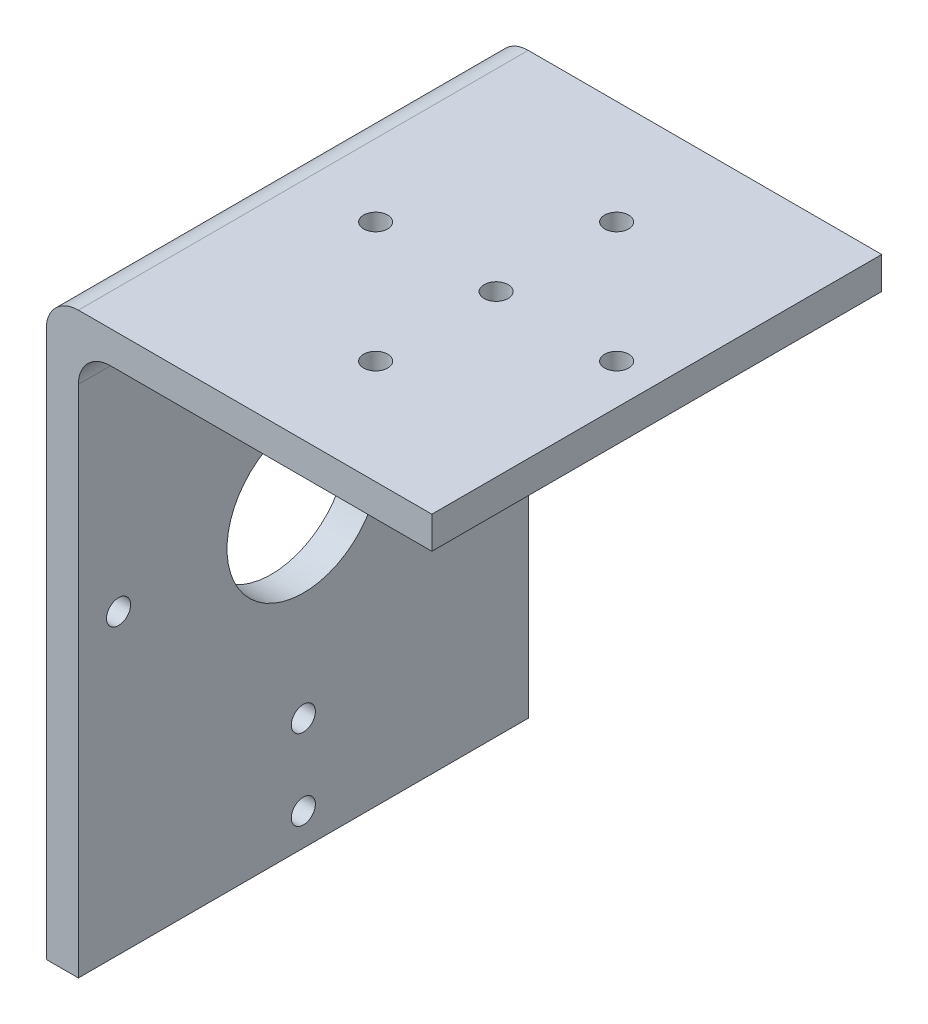
ISO-10303-21;
HEADER;
FILE_DESCRIPTION(('STEP AP214'),'2;1');
FILE_NAME('part.step','',(''),(''),'','','');
FILE_SCHEMA(('AUTOMOTIVE_DESIGN { 1 0 10303 214 1 1 1 1 }'));
ENDSEC;
DATA;
#1=APPLICATION_CONTEXT('core data for automotive mechanical design processes');
#2=APPLICATION_PROTOCOL_DEFINITION('international standard','automotive_design',2000,#1);
#3=PRODUCT_CONTEXT('',#1,'mechanical');
#4=PRODUCT('Part','Part','',(#3));
#5=PRODUCT_RELATED_PRODUCT_CATEGORY('part','',(#4));
#6=PRODUCT_DEFINITION_FORMATION('','',#4);
#7=PRODUCT_DEFINITION_CONTEXT('part definition',#1,'design');
#8=PRODUCT_DEFINITION('design','',#6,#7);
#9=PRODUCT_DEFINITION_SHAPE('','',#8);
#10=(LENGTH_UNIT() NAMED_UNIT(*) SI_UNIT(.MILLI.,.METRE.));
#11=(NAMED_UNIT(*) PLANE_ANGLE_UNIT() SI_UNIT($,.RADIAN.));
#12=(NAMED_UNIT(*) SI_UNIT($,.STERADIAN.) SOLID_ANGLE_UNIT());
#13=UNCERTAINTY_MEASURE_WITH_UNIT(LENGTH_MEASURE(1.E-05),#10,'distance_accuracy_value','');
#14=(GEOMETRIC_REPRESENTATION_CONTEXT(3) GLOBAL_UNCERTAINTY_ASSIGNED_CONTEXT((#13)) GLOBAL_UNIT_ASSIGNED_CONTEXT((#10,
#11,#12)) REPRESENTATION_CONTEXT('',''));
#15=CARTESIAN_POINT('',(0.,0.,0.));
#16=DIRECTION('',(0.,0.,1.));
#17=DIRECTION('',(1.,0.,0.));
#18=AXIS2_PLACEMENT_3D('',#15,#16,#17);
#19=CARTESIAN_POINT('',(-30.3062448440852,12.6016746411483,-28.));
#20=DIRECTION('',(-1.,0.,0.));
#21=DIRECTION('',(0.,-1.,0.));
#22=AXIS2_PLACEMENT_3D('',#19,#20,#21);
#23=PLANE('',#22);
#24=CARTESIAN_POINT('',(-30.3062448440851,-55.3983253588517,0.));
#25=DIRECTION('',(1.,0.,0.));
#26=DIRECTION('',(0.,0.,-1.));
#27=AXIS2_PLACEMENT_3D('',#24,#25,#26);
#28=CIRCLE('',#27,1.5);
#29=CARTESIAN_POINT('',(-30.3062448440851,-55.3983253588517,-1.5));
#30=VERTEX_POINT('',#29);
#31=EDGE_CURVE('E342',#30,#30,#28,.T.);
#32=ORIENTED_EDGE('',*,*,#31,.T.);
#33=EDGE_LOOP('',(#32));
#34=FACE_BOUND('',#33,.T.);
#35=CARTESIAN_POINT('',(-30.3062448440851,-45.3983253588517,0.));
#36=DIRECTION('',(1.,0.,0.));
#37=DIRECTION('',(0.,0.,-1.));
#38=AXIS2_PLACEMENT_3D('',#35,#36,#37);
#39=CIRCLE('',#38,1.5);
#40=CARTESIAN_POINT('',(-30.3062448440851,-45.3983253588517,-1.5));
#41=VERTEX_POINT('',#40);
#42=EDGE_CURVE('E348',#41,#41,#39,.T.);
#43=ORIENTED_EDGE('',*,*,#42,.T.);
#44=EDGE_LOOP('',(#43));
#45=FACE_BOUND('',#44,.T.);
#46=CARTESIAN_POINT('',(-30.3062448440851,-22.3983253588517,-23.));
#47=DIRECTION('',(1.,0.,0.));
#48=DIRECTION('',(0.,0.,-1.));
#49=AXIS2_PLACEMENT_3D('',#46,#47,#48);
#50=CIRCLE('',#49,1.5);
#51=CARTESIAN_POINT('',(-30.3062448440851,-22.3983253588517,-24.5));
#52=VERTEX_POINT('',#51);
#53=EDGE_CURVE('E353',#52,#52,#50,.T.);
#54=ORIENTED_EDGE('',*,*,#53,.T.);
#55=EDGE_LOOP('',(#54));
#56=FACE_BOUND('',#55,.T.);
#57=CARTESIAN_POINT('',(-30.3062448440851,0.601674641148332,0.));
#58=DIRECTION('',(1.,0.,0.));
#59=DIRECTION('',(0.,0.,-1.));
#60=AXIS2_PLACEMENT_3D('',#57,#58,#59);
#61=CIRCLE('',#60,1.5);
#62=CARTESIAN_POINT('',(-30.3062448440851,0.601674641148332,-1.5));
#63=VERTEX_POINT('',#62);
#64=EDGE_CURVE('E359',#63,#63,#61,.T.);
#65=ORIENTED_EDGE('',*,*,#64,.T.);
#66=EDGE_LOOP('',(#65));
#67=FACE_BOUND('',#66,.T.);
#68=CARTESIAN_POINT('',(-30.3062448440851,-22.3983253588517,23.));
#69=DIRECTION('',(1.,0.,0.));
#70=DIRECTION('',(0.,0.,-1.));
#71=AXIS2_PLACEMENT_3D('',#68,#69,#70);
#72=CIRCLE('',#71,1.5);
#73=CARTESIAN_POINT('',(-30.3062448440851,-22.3983253588517,21.5));
#74=VERTEX_POINT('',#73);
#75=EDGE_CURVE('E365',#74,#74,#72,.T.);
#76=ORIENTED_EDGE('',*,*,#75,.T.);
#77=EDGE_LOOP('',(#76));
#78=FACE_BOUND('',#77,.T.);
#79=CARTESIAN_POINT('',(-30.3062448440851,-22.3983253588517,0.));
#80=DIRECTION('',(1.,0.,0.));
#81=DIRECTION('',(0.,0.,-1.));
#82=AXIS2_PLACEMENT_3D('',#79,#80,#81);
#83=CIRCLE('',#82,9.5);
#84=CARTESIAN_POINT('',(-30.3062448440851,-22.3983253588517,-9.5));
#85=VERTEX_POINT('',#84);
#86=EDGE_CURVE('E102',#85,#85,#83,.T.);
#87=ORIENTED_EDGE('',*,*,#86,.T.);
#88=EDGE_LOOP('',(#87));
#89=FACE_BOUND('',#88,.T.);
#90=DIRECTION('',(0.,-1.,0.));
#91=VECTOR('',#90,1.);
#92=CARTESIAN_POINT('',(-30.3062448440852,12.6016746411483,28.));
#93=LINE('',#92,#91);
#94=CARTESIAN_POINT('',(-30.3062448440852,8.60167464114834,28.));
#95=VERTEX_POINT('',#94);
#96=CARTESIAN_POINT('',(-30.3062448440851,-59.3983253588517,28.));
#97=VERTEX_POINT('',#96);
#98=EDGE_CURVE('E95',#95,#97,#93,.T.);
#99=ORIENTED_EDGE('',*,*,#98,.F.);
#100=DIRECTION('',(0.,0.,1.));
#101=VECTOR('',#100,1.);
#102=CARTESIAN_POINT('',(-30.3062448440852,8.60167464114834,-28.));
#103=LINE('',#102,#101);
#104=CARTESIAN_POINT('',(-30.3062448440852,8.60167464114834,-28.));
#105=VERTEX_POINT('',#104);
#106=EDGE_CURVE('E48',#95,#105,#103,.F.);
#107=ORIENTED_EDGE('',*,*,#106,.T.);
#108=DIRECTION('',(0.,-1.,0.));
#109=VECTOR('',#108,1.);
#110=CARTESIAN_POINT('',(-30.3062448440852,12.6016746411483,-28.));
#111=LINE('',#110,#109);
#112=CARTESIAN_POINT('',(-30.3062448440851,-59.3983253588517,-28.));
#113=VERTEX_POINT('',#112);
#114=EDGE_CURVE('E106',#105,#113,#111,.T.);
#115=ORIENTED_EDGE('',*,*,#114,.T.);
#116=DIRECTION('',(0.,0.,1.));
#117=VECTOR('',#116,1.);
#118=CARTESIAN_POINT('',(-30.3062448440851,-59.3983253588517,-28.));
#119=LINE('',#118,#117);
#120=EDGE_CURVE('E105',#113,#97,#119,.T.);
#121=ORIENTED_EDGE('',*,*,#120,.T.);
#122=EDGE_LOOP('',(#99,#107,#115,#121));
#123=FACE_BOUND('',#122,.T.);
#124=ADVANCED_FACE('F33',(#34,#45,#56,#67,#78,#89,#123),#23,.T.);
#125=CARTESIAN_POINT('',(17.6937551559149,12.6016746411483,-28.));
#126=DIRECTION('',(0.,1.,0.));
#127=DIRECTION('',(-1.,0.,0.));
#128=AXIS2_PLACEMENT_3D('',#125,#126,#127);
#129=PLANE('',#128);
#130=CARTESIAN_POINT('',(-2.3062448440853,12.6016746411483,-15.));
#131=DIRECTION('',(0.,-1.,0.));
#132=DIRECTION('',(0.,0.,-1.));
#133=AXIS2_PLACEMENT_3D('',#130,#131,#132);
#134=CIRCLE('',#133,1.5);
#135=CARTESIAN_POINT('',(-2.3062448440853,12.6016746411483,-16.5));
#136=VERTEX_POINT('',#135);
#137=EDGE_CURVE('E313',#136,#136,#134,.T.);
#138=ORIENTED_EDGE('',*,*,#137,.T.);
#139=EDGE_LOOP('',(#138));
#140=FACE_BOUND('',#139,.T.);
#141=CARTESIAN_POINT('',(12.6937551559149,12.6016746411483,-1.04744440165294E-13));
#142=DIRECTION('',(0.,-1.,0.));
#143=DIRECTION('',(0.,0.,-1.));
#144=AXIS2_PLACEMENT_3D('',#141,#142,#143);
#145=CIRCLE('',#144,1.5);
#146=CARTESIAN_POINT('',(12.6937551559149,12.6016746411483,-1.50000000000011));
#147=VERTEX_POINT('',#146);
#148=EDGE_CURVE('E321',#147,#147,#145,.T.);
#149=ORIENTED_EDGE('',*,*,#148,.T.);
#150=EDGE_LOOP('',(#149));
#151=FACE_BOUND('',#150,.T.);
#152=CARTESIAN_POINT('',(-2.30624484408509,12.6016746411483,15.));
#153=DIRECTION('',(0.,-1.,0.));
#154=DIRECTION('',(0.,0.,-1.));
#155=AXIS2_PLACEMENT_3D('',#152,#153,#154);
#156=CIRCLE('',#155,1.5);
#157=CARTESIAN_POINT('',(-2.30624484408509,12.6016746411483,13.5));
#158=VERTEX_POINT('',#157);
#159=EDGE_CURVE('E327',#158,#158,#156,.T.);
#160=ORIENTED_EDGE('',*,*,#159,.T.);
#161=EDGE_LOOP('',(#160));
#162=FACE_BOUND('',#161,.T.);
#163=CARTESIAN_POINT('',(-17.3062448440851,12.6016746411483,0.));
#164=DIRECTION('',(0.,-1.,0.));
#165=DIRECTION('',(0.,0.,-1.));
#166=AXIS2_PLACEMENT_3D('',#163,#164,#165);
#167=CIRCLE('',#166,1.5);
#168=CARTESIAN_POINT('',(-17.3062448440851,12.6016746411483,-1.5));
#169=VERTEX_POINT('',#168);
#170=EDGE_CURVE('E333',#169,#169,#167,.T.);
#171=ORIENTED_EDGE('',*,*,#170,.T.);
#172=EDGE_LOOP('',(#171));
#173=FACE_BOUND('',#172,.T.);
#174=CARTESIAN_POINT('',(-2.30624484408514,12.6016746411483,0.));
#175=DIRECTION('',(0.,-1.,0.));
#176=DIRECTION('',(0.,0.,-1.));
#177=AXIS2_PLACEMENT_3D('',#174,#175,#176);
#178=CIRCLE('',#177,1.5);
#179=CARTESIAN_POINT('',(-2.30624484408514,12.6016746411483,-1.5));
#180=VERTEX_POINT('',#179);
#181=EDGE_CURVE('E339',#180,#180,#178,.T.);
#182=ORIENTED_EDGE('',*,*,#181,.T.);
#183=EDGE_LOOP('',(#182));
#184=FACE_BOUND('',#183,.T.);
#185=DIRECTION('',(-1.,0.,0.));
#186=VECTOR('',#185,1.);
#187=CARTESIAN_POINT('',(17.6937551559149,12.6016746411483,-28.));
#188=LINE('',#187,#186);
#189=CARTESIAN_POINT('',(17.6937551559149,12.6016746411483,-28.));
#190=VERTEX_POINT('',#189);
#191=CARTESIAN_POINT('',(-26.3062448440851,12.6016746411483,-28.));
#192=VERTEX_POINT('',#191);
#193=EDGE_CURVE('E111',#190,#192,#188,.T.);
#194=ORIENTED_EDGE('',*,*,#193,.T.);
#195=DIRECTION('',(0.,0.,1.));
#196=VECTOR('',#195,1.);
#197=CARTESIAN_POINT('',(-26.3062448440851,12.6016746411483,-28.));
#198=LINE('',#197,#196);
#199=CARTESIAN_POINT('',(-26.3062448440851,12.6016746411483,28.));
#200=VERTEX_POINT('',#199);
#201=EDGE_CURVE('E150',#192,#200,#198,.T.);
#202=ORIENTED_EDGE('',*,*,#201,.T.);
#203=DIRECTION('',(-1.,0.,0.));
#204=VECTOR('',#203,1.);
#205=CARTESIAN_POINT('',(17.6937551559149,12.6016746411483,28.));
#206=LINE('',#205,#204);
#207=CARTESIAN_POINT('',(17.6937551559149,12.6016746411483,28.));
#208=VERTEX_POINT('',#207);
#209=EDGE_CURVE('E124',#208,#200,#206,.T.);
#210=ORIENTED_EDGE('',*,*,#209,.F.);
#211=DIRECTION('',(0.,0.,1.));
#212=VECTOR('',#211,1.);
#213=CARTESIAN_POINT('',(17.6937551559149,12.6016746411483,-28.));
#214=LINE('',#213,#212);
#215=EDGE_CURVE('E139',#190,#208,#214,.T.);
#216=ORIENTED_EDGE('',*,*,#215,.F.);
#217=EDGE_LOOP('',(#194,#202,#210,#216));
#218=FACE_BOUND('',#217,.T.);
#219=ADVANCED_FACE('F187',(#140,#151,#162,#173,#184,#218),#129,.T.);
#220=CARTESIAN_POINT('',(17.6937551559149,8.60167464114833,-28.));
#221=DIRECTION('',(1.,0.,0.));
#222=DIRECTION('',(0.,0.,-1.));
#223=AXIS2_PLACEMENT_3D('',#220,#221,#222);
#224=PLANE('',#223);
#225=ORIENTED_EDGE('',*,*,#215,.T.);
#226=DIRECTION('',(0.,1.,0.));
#227=VECTOR('',#226,1.);
#228=CARTESIAN_POINT('',(17.6937551559149,8.60167464114833,28.));
#229=LINE('',#228,#227);
#230=CARTESIAN_POINT('',(17.6937551559149,8.60167464114833,28.));
#231=VERTEX_POINT('',#230);
#232=EDGE_CURVE('E121',#231,#208,#229,.T.);
#233=ORIENTED_EDGE('',*,*,#232,.F.);
#234=DIRECTION('',(0.,0.,1.));
#235=VECTOR('',#234,1.);
#236=CARTESIAN_POINT('',(17.6937551559149,8.60167464114833,-28.));
#237=LINE('',#236,#235);
#238=CARTESIAN_POINT('',(17.6937551559149,8.60167464114833,-28.));
#239=VERTEX_POINT('',#238);
#240=EDGE_CURVE('E142',#239,#231,#237,.T.);
#241=ORIENTED_EDGE('',*,*,#240,.F.);
#242=DIRECTION('',(0.,1.,0.));
#243=VECTOR('',#242,1.);
#244=CARTESIAN_POINT('',(17.6937551559149,8.60167464114833,-28.));
#245=LINE('',#244,#243);
#246=EDGE_CURVE('E134',#239,#190,#245,.T.);
#247=ORIENTED_EDGE('',*,*,#246,.T.);
#248=EDGE_LOOP('',(#225,#233,#241,#247));
#249=FACE_BOUND('',#248,.T.);
#250=ADVANCED_FACE('F181',(#249),#224,.T.);
#251=CARTESIAN_POINT('',(-26.3062448440851,8.60167464114833,-28.));
#252=DIRECTION('',(0.,-1.,0.));
#253=DIRECTION('',(0.,0.,-1.));
#254=AXIS2_PLACEMENT_3D('',#251,#252,#253);
#255=PLANE('',#254);
#256=CARTESIAN_POINT('',(-2.3062448440853,8.60167464114833,-15.));
#257=DIRECTION('',(0.,-1.,0.));
#258=DIRECTION('',(0.,0.,-1.));
#259=AXIS2_PLACEMENT_3D('',#256,#257,#258);
#260=CIRCLE('',#259,1.5);
#261=CARTESIAN_POINT('',(-2.3062448440853,8.60167464114833,-16.5));
#262=VERTEX_POINT('',#261);
#263=EDGE_CURVE('E316',#262,#262,#260,.T.);
#264=ORIENTED_EDGE('',*,*,#263,.F.);
#265=EDGE_LOOP('',(#264));
#266=FACE_BOUND('',#265,.T.);
#267=CARTESIAN_POINT('',(12.6937551559149,8.60167464114833,-1.04744440165294E-13));
#268=DIRECTION('',(0.,-1.,0.));
#269=DIRECTION('',(0.,0.,-1.));
#270=AXIS2_PLACEMENT_3D('',#267,#268,#269);
#271=CIRCLE('',#270,1.5);
#272=CARTESIAN_POINT('',(12.6937551559149,8.60167464114833,-1.50000000000011));
#273=VERTEX_POINT('',#272);
#274=EDGE_CURVE('E318',#273,#273,#271,.T.);
#275=ORIENTED_EDGE('',*,*,#274,.F.);
#276=EDGE_LOOP('',(#275));
#277=FACE_BOUND('',#276,.T.);
#278=CARTESIAN_POINT('',(-2.30624484408509,8.60167464114833,15.));
#279=DIRECTION('',(0.,-1.,0.));
#280=DIRECTION('',(0.,0.,-1.));
#281=AXIS2_PLACEMENT_3D('',#278,#279,#280);
#282=CIRCLE('',#281,1.5);
#283=CARTESIAN_POINT('',(-2.30624484408509,8.60167464114833,13.5));
#284=VERTEX_POINT('',#283);
#285=EDGE_CURVE('E324',#284,#284,#282,.T.);
#286=ORIENTED_EDGE('',*,*,#285,.F.);
#287=EDGE_LOOP('',(#286));
#288=FACE_BOUND('',#287,.T.);
#289=CARTESIAN_POINT('',(-17.3062448440851,8.60167464114833,0.));
#290=DIRECTION('',(0.,-1.,0.));
#291=DIRECTION('',(0.,0.,-1.));
#292=AXIS2_PLACEMENT_3D('',#289,#290,#291);
#293=CIRCLE('',#292,1.5);
#294=CARTESIAN_POINT('',(-17.3062448440851,8.60167464114833,-1.5));
#295=VERTEX_POINT('',#294);
#296=EDGE_CURVE('E330',#295,#295,#293,.T.);
#297=ORIENTED_EDGE('',*,*,#296,.F.);
#298=EDGE_LOOP('',(#297));
#299=FACE_BOUND('',#298,.T.);
#300=CARTESIAN_POINT('',(-2.30624484408514,8.60167464114833,0.));
#301=DIRECTION('',(0.,-1.,0.));
#302=DIRECTION('',(0.,0.,-1.));
#303=AXIS2_PLACEMENT_3D('',#300,#301,#302);
#304=CIRCLE('',#303,1.5);
#305=CARTESIAN_POINT('',(-2.30624484408514,8.60167464114833,-1.5));
#306=VERTEX_POINT('',#305);
#307=EDGE_CURVE('E336',#306,#306,#304,.T.);
#308=ORIENTED_EDGE('',*,*,#307,.F.);
#309=EDGE_LOOP('',(#308));
#310=FACE_BOUND('',#309,.T.);
#311=DIRECTION('',(1.,0.,0.));
#312=VECTOR('',#311,1.);
#313=CARTESIAN_POINT('',(-26.3062448440851,8.60167464114833,28.));
#314=LINE('',#313,#312);
#315=CARTESIAN_POINT('',(-22.3062448440851,8.60167464114833,28.));
#316=VERTEX_POINT('',#315);
#317=EDGE_CURVE('E116',#316,#231,#314,.T.);
#318=ORIENTED_EDGE('',*,*,#317,.F.);
#319=DIRECTION('',(0.,0.,1.));
#320=VECTOR('',#319,1.);
#321=CARTESIAN_POINT('',(-22.3062448440851,8.60167464114833,-28.));
#322=LINE('',#321,#320);
#323=CARTESIAN_POINT('',(-22.3062448440851,8.60167464114833,-28.));
#324=VERTEX_POINT('',#323);
#325=EDGE_CURVE('E148',#316,#324,#322,.F.);
#326=ORIENTED_EDGE('',*,*,#325,.T.);
#327=DIRECTION('',(1.,0.,0.));
#328=VECTOR('',#327,1.);
#329=CARTESIAN_POINT('',(-26.3062448440851,8.60167464114833,-28.));
#330=LINE('',#329,#328);
#331=EDGE_CURVE('E132',#324,#239,#330,.T.);
#332=ORIENTED_EDGE('',*,*,#331,.T.);
#333=ORIENTED_EDGE('',*,*,#240,.T.);
#334=EDGE_LOOP('',(#318,#326,#332,#333));
#335=FACE_BOUND('',#334,.T.);
#336=ADVANCED_FACE('F161',(#266,#277,#288,#299,#310,#335),#255,.T.);
#337=CARTESIAN_POINT('',(-26.3062448440851,-59.3983253588517,-28.));
#338=DIRECTION('',(1.,0.,0.));
#339=DIRECTION('',(0.,0.,-1.));
#340=AXIS2_PLACEMENT_3D('',#337,#338,#339);
#341=PLANE('',#340);
#342=CARTESIAN_POINT('',(-26.3062448440851,-55.3983253588517,0.));
#343=DIRECTION('',(1.,0.,0.));
#344=DIRECTION('',(0.,0.,-1.));
#345=AXIS2_PLACEMENT_3D('',#342,#343,#344);
#346=CIRCLE('',#345,1.5);
#347=CARTESIAN_POINT('',(-26.3062448440851,-55.3983253588517,-1.5));
#348=VERTEX_POINT('',#347);
#349=EDGE_CURVE('E345',#348,#348,#346,.T.);
#350=ORIENTED_EDGE('',*,*,#349,.F.);
#351=EDGE_LOOP('',(#350));
#352=FACE_BOUND('',#351,.T.);
#353=CARTESIAN_POINT('',(-26.3062448440851,-45.3983253588517,0.));
#354=DIRECTION('',(1.,0.,0.));
#355=DIRECTION('',(0.,0.,-1.));
#356=AXIS2_PLACEMENT_3D('',#353,#354,#355);
#357=CIRCLE('',#356,1.5);
#358=CARTESIAN_POINT('',(-26.3062448440851,-45.3983253588517,-1.5));
#359=VERTEX_POINT('',#358);
#360=EDGE_CURVE('E350',#359,#359,#357,.T.);
#361=ORIENTED_EDGE('',*,*,#360,.F.);
#362=EDGE_LOOP('',(#361));
#363=FACE_BOUND('',#362,.T.);
#364=CARTESIAN_POINT('',(-26.3062448440851,-22.3983253588517,-23.));
#365=DIRECTION('',(1.,0.,0.));
#366=DIRECTION('',(0.,0.,-1.));
#367=AXIS2_PLACEMENT_3D('',#364,#365,#366);
#368=CIRCLE('',#367,1.5);
#369=CARTESIAN_POINT('',(-26.3062448440851,-22.3983253588517,-24.5));
#370=VERTEX_POINT('',#369);
#371=EDGE_CURVE('E356',#370,#370,#368,.T.);
#372=ORIENTED_EDGE('',*,*,#371,.F.);
#373=EDGE_LOOP('',(#372));
#374=FACE_BOUND('',#373,.T.);
#375=CARTESIAN_POINT('',(-26.3062448440851,0.601674641148332,0.));
#376=DIRECTION('',(1.,0.,0.));
#377=DIRECTION('',(0.,0.,-1.));
#378=AXIS2_PLACEMENT_3D('',#375,#376,#377);
#379=CIRCLE('',#378,1.5);
#380=CARTESIAN_POINT('',(-26.3062448440851,0.601674641148332,-1.5));
#381=VERTEX_POINT('',#380);
#382=EDGE_CURVE('E362',#381,#381,#379,.T.);
#383=ORIENTED_EDGE('',*,*,#382,.F.);
#384=EDGE_LOOP('',(#383));
#385=FACE_BOUND('',#384,.T.);
#386=CARTESIAN_POINT('',(-26.3062448440851,-22.3983253588517,23.));
#387=DIRECTION('',(1.,0.,0.));
#388=DIRECTION('',(0.,0.,-1.));
#389=AXIS2_PLACEMENT_3D('',#386,#387,#388);
#390=CIRCLE('',#389,1.5);
#391=CARTESIAN_POINT('',(-26.3062448440851,-22.3983253588517,21.5));
#392=VERTEX_POINT('',#391);
#393=EDGE_CURVE('E368',#392,#392,#390,.T.);
#394=ORIENTED_EDGE('',*,*,#393,.F.);
#395=EDGE_LOOP('',(#394));
#396=FACE_BOUND('',#395,.T.);
#397=CARTESIAN_POINT('',(-26.3062448440851,-22.3983253588517,0.));
#398=DIRECTION('',(1.,0.,0.));
#399=DIRECTION('',(0.,0.,-1.));
#400=AXIS2_PLACEMENT_3D('',#397,#398,#399);
#401=CIRCLE('',#400,9.5);
#402=CARTESIAN_POINT('',(-26.3062448440851,-22.3983253588517,-9.5));
#403=VERTEX_POINT('',#402);
#404=EDGE_CURVE('E371',#403,#403,#401,.T.);
#405=ORIENTED_EDGE('',*,*,#404,.F.);
#406=EDGE_LOOP('',(#405));
#407=FACE_BOUND('',#406,.T.);
#408=DIRECTION('',(0.,1.,0.));
#409=VECTOR('',#408,1.);
#410=CARTESIAN_POINT('',(-26.3062448440851,-59.3983253588517,-28.));
#411=LINE('',#410,#409);
#412=CARTESIAN_POINT('',(-26.3062448440851,-59.3983253588517,-28.));
#413=VERTEX_POINT('',#412);
#414=CARTESIAN_POINT('',(-26.3062448440851,4.60167464114831,-28.));
#415=VERTEX_POINT('',#414);
#416=EDGE_CURVE('E129',#413,#415,#411,.T.);
#417=ORIENTED_EDGE('',*,*,#416,.T.);
#418=DIRECTION('',(0.,0.,1.));
#419=VECTOR('',#418,1.);
#420=CARTESIAN_POINT('',(-26.3062448440851,4.60167464114831,28.));
#421=LINE('',#420,#419);
#422=CARTESIAN_POINT('',(-26.3062448440851,4.60167464114831,28.));
#423=VERTEX_POINT('',#422);
#424=EDGE_CURVE('E141',#415,#423,#421,.T.);
#425=ORIENTED_EDGE('',*,*,#424,.T.);
#426=DIRECTION('',(0.,1.,0.));
#427=VECTOR('',#426,1.);
#428=CARTESIAN_POINT('',(-26.3062448440851,-59.3983253588517,28.));
#429=LINE('',#428,#427);
#430=CARTESIAN_POINT('',(-26.3062448440851,-59.3983253588517,28.));
#431=VERTEX_POINT('',#430);
#432=EDGE_CURVE('E114',#431,#423,#429,.T.);
#433=ORIENTED_EDGE('',*,*,#432,.F.);
#434=DIRECTION('',(0.,0.,1.));
#435=VECTOR('',#434,1.);
#436=CARTESIAN_POINT('',(-26.3062448440851,-59.3983253588517,-28.));
#437=LINE('',#436,#435);
#438=EDGE_CURVE('E110',#413,#431,#437,.T.);
#439=ORIENTED_EDGE('',*,*,#438,.F.);
#440=EDGE_LOOP('',(#417,#425,#433,#439));
#441=FACE_BOUND('',#440,.T.);
#442=ADVANCED_FACE('F172',(#352,#363,#374,#385,#396,#407,#441),#341,.T.);
#443=CARTESIAN_POINT('',(-30.3062448440851,-59.3983253588517,-28.));
#444=DIRECTION('',(0.,-1.,0.));
#445=DIRECTION('',(0.,0.,-1.));
#446=AXIS2_PLACEMENT_3D('',#443,#444,#445);
#447=PLANE('',#446);
#448=ORIENTED_EDGE('',*,*,#438,.T.);
#449=DIRECTION('',(1.,0.,0.));
#450=VECTOR('',#449,1.);
#451=CARTESIAN_POINT('',(-30.3062448440851,-59.3983253588517,28.));
#452=LINE('',#451,#450);
#453=EDGE_CURVE('E100',#97,#431,#452,.T.);
#454=ORIENTED_EDGE('',*,*,#453,.F.);
#455=ORIENTED_EDGE('',*,*,#120,.F.);
#456=DIRECTION('',(1.,0.,0.));
#457=VECTOR('',#456,1.);
#458=CARTESIAN_POINT('',(-30.3062448440851,-59.3983253588517,-28.));
#459=LINE('',#458,#457);
#460=EDGE_CURVE('E127',#113,#413,#459,.T.);
#461=ORIENTED_EDGE('',*,*,#460,.T.);
#462=EDGE_LOOP('',(#448,#454,#455,#461));
#463=FACE_BOUND('',#462,.T.);
#464=ADVANCED_FACE('F113',(#463),#447,.T.);
#465=CARTESIAN_POINT('',(0.,0.,-28.));
#466=DIRECTION('',(0.,0.,1.));
#467=DIRECTION('',(1.,0.,0.));
#468=AXIS2_PLACEMENT_3D('',#465,#466,#467);
#469=PLANE('',#468);
#470=ORIENTED_EDGE('',*,*,#114,.F.);
#471=CARTESIAN_POINT('',(-26.3062448440851,8.60167464114834,-28.));
#472=DIRECTION('',(0.,0.,1.));
#473=DIRECTION('',(1.,0.,0.));
#474=AXIS2_PLACEMENT_3D('',#471,#472,#473);
#475=CIRCLE('',#474,4.);
#476=EDGE_CURVE('E155',#105,#192,#475,.F.);
#477=ORIENTED_EDGE('',*,*,#476,.T.);
#478=ORIENTED_EDGE('',*,*,#193,.F.);
#479=ORIENTED_EDGE('',*,*,#246,.F.);
#480=ORIENTED_EDGE('',*,*,#331,.F.);
#481=CARTESIAN_POINT('',(-22.3062448440851,4.60167464114831,-28.));
#482=DIRECTION('',(0.,0.,1.));
#483=DIRECTION('',(1.,0.,0.));
#484=AXIS2_PLACEMENT_3D('',#481,#482,#483);
#485=CIRCLE('',#484,4.);
#486=EDGE_CURVE('E11',#324,#415,#485,.T.);
#487=ORIENTED_EDGE('',*,*,#486,.T.);
#488=ORIENTED_EDGE('',*,*,#416,.F.);
#489=ORIENTED_EDGE('',*,*,#460,.F.);
#490=EDGE_LOOP('',(#470,#477,#478,#479,#480,#487,#488,#489));
#491=FACE_BOUND('',#490,.T.);
#492=ADVANCED_FACE('F169',(#491),#469,.F.);
#493=CARTESIAN_POINT('',(0.,0.,28.));
#494=DIRECTION('',(0.,0.,1.));
#495=DIRECTION('',(1.,0.,0.));
#496=AXIS2_PLACEMENT_3D('',#493,#494,#495);
#497=PLANE('',#496);
#498=ORIENTED_EDGE('',*,*,#209,.T.);
#499=CARTESIAN_POINT('',(-26.3062448440851,8.60167464114834,28.));
#500=DIRECTION('',(0.,0.,1.));
#501=DIRECTION('',(1.,0.,0.));
#502=AXIS2_PLACEMENT_3D('',#499,#500,#501);
#503=CIRCLE('',#502,4.);
#504=EDGE_CURVE('E56',#200,#95,#503,.T.);
#505=ORIENTED_EDGE('',*,*,#504,.T.);
#506=ORIENTED_EDGE('',*,*,#98,.T.);
#507=ORIENTED_EDGE('',*,*,#453,.T.);
#508=ORIENTED_EDGE('',*,*,#432,.T.);
#509=CARTESIAN_POINT('',(-22.3062448440851,4.60167464114831,28.));
#510=DIRECTION('',(0.,0.,1.));
#511=DIRECTION('',(1.,0.,0.));
#512=AXIS2_PLACEMENT_3D('',#509,#510,#511);
#513=CIRCLE('',#512,4.);
#514=EDGE_CURVE('E41',#423,#316,#513,.F.);
#515=ORIENTED_EDGE('',*,*,#514,.T.);
#516=ORIENTED_EDGE('',*,*,#317,.T.);
#517=ORIENTED_EDGE('',*,*,#232,.T.);
#518=EDGE_LOOP('',(#498,#505,#506,#507,#508,#515,#516,#517));
#519=FACE_BOUND('',#518,.T.);
#520=ADVANCED_FACE('F97',(#519),#497,.T.);
#521=CARTESIAN_POINT('',(-30.3062448440851,-22.3983253588517,0.));
#522=DIRECTION('',(1.,0.,0.));
#523=DIRECTION('',(0.,0.,-1.));
#524=AXIS2_PLACEMENT_3D('',#521,#522,#523);
#525=CYLINDRICAL_SURFACE('',#524,9.5);
#526=ORIENTED_EDGE('',*,*,#86,.F.);
#527=EDGE_LOOP('',(#526));
#528=FACE_BOUND('',#527,.T.);
#529=ORIENTED_EDGE('',*,*,#404,.T.);
#530=EDGE_LOOP('',(#529));
#531=FACE_BOUND('',#530,.T.);
#532=ADVANCED_FACE('F229',(#528,#531),#525,.F.);
#533=CARTESIAN_POINT('',(-30.3062448440851,-22.3983253588517,23.));
#534=DIRECTION('',(1.,0.,0.));
#535=DIRECTION('',(0.,0.,-1.));
#536=AXIS2_PLACEMENT_3D('',#533,#534,#535);
#537=CYLINDRICAL_SURFACE('',#536,1.5);
#538=ORIENTED_EDGE('',*,*,#75,.F.);
#539=EDGE_LOOP('',(#538));
#540=FACE_BOUND('',#539,.T.);
#541=ORIENTED_EDGE('',*,*,#393,.T.);
#542=EDGE_LOOP('',(#541));
#543=FACE_BOUND('',#542,.T.);
#544=ADVANCED_FACE('F225',(#540,#543),#537,.F.);
#545=CARTESIAN_POINT('',(-30.3062448440851,0.601674641148332,0.));
#546=DIRECTION('',(1.,0.,0.));
#547=DIRECTION('',(0.,0.,-1.));
#548=AXIS2_PLACEMENT_3D('',#545,#546,#547);
#549=CYLINDRICAL_SURFACE('',#548,1.5);
#550=ORIENTED_EDGE('',*,*,#64,.F.);
#551=EDGE_LOOP('',(#550));
#552=FACE_BOUND('',#551,.T.);
#553=ORIENTED_EDGE('',*,*,#382,.T.);
#554=EDGE_LOOP('',(#553));
#555=FACE_BOUND('',#554,.T.);
#556=ADVANCED_FACE('F221',(#552,#555),#549,.F.);
#557=CARTESIAN_POINT('',(-30.3062448440851,-22.3983253588517,-23.));
#558=DIRECTION('',(1.,0.,0.));
#559=DIRECTION('',(0.,0.,-1.));
#560=AXIS2_PLACEMENT_3D('',#557,#558,#559);
#561=CYLINDRICAL_SURFACE('',#560,1.5);
#562=ORIENTED_EDGE('',*,*,#53,.F.);
#563=EDGE_LOOP('',(#562));
#564=FACE_BOUND('',#563,.T.);
#565=ORIENTED_EDGE('',*,*,#371,.T.);
#566=EDGE_LOOP('',(#565));
#567=FACE_BOUND('',#566,.T.);
#568=ADVANCED_FACE('F211',(#564,#567),#561,.F.);
#569=CARTESIAN_POINT('',(-30.3062448440851,-45.3983253588517,0.));
#570=DIRECTION('',(1.,0.,0.));
#571=DIRECTION('',(0.,0.,-1.));
#572=AXIS2_PLACEMENT_3D('',#569,#570,#571);
#573=CYLINDRICAL_SURFACE('',#572,1.5);
#574=ORIENTED_EDGE('',*,*,#42,.F.);
#575=EDGE_LOOP('',(#574));
#576=FACE_BOUND('',#575,.T.);
#577=ORIENTED_EDGE('',*,*,#360,.T.);
#578=EDGE_LOOP('',(#577));
#579=FACE_BOUND('',#578,.T.);
#580=ADVANCED_FACE('F205',(#576,#579),#573,.F.);
#581=CARTESIAN_POINT('',(-30.3062448440851,-55.3983253588517,0.));
#582=DIRECTION('',(1.,0.,0.));
#583=DIRECTION('',(0.,0.,-1.));
#584=AXIS2_PLACEMENT_3D('',#581,#582,#583);
#585=CYLINDRICAL_SURFACE('',#584,1.5);
#586=ORIENTED_EDGE('',*,*,#31,.F.);
#587=EDGE_LOOP('',(#586));
#588=FACE_BOUND('',#587,.T.);
#589=ORIENTED_EDGE('',*,*,#349,.T.);
#590=EDGE_LOOP('',(#589));
#591=FACE_BOUND('',#590,.T.);
#592=ADVANCED_FACE('F198',(#588,#591),#585,.F.);
#593=CARTESIAN_POINT('',(-22.3062448440851,4.60167464114831,-28.));
#594=DIRECTION('',(0.,0.,-1.));
#595=DIRECTION('',(-1.,0.,0.));
#596=AXIS2_PLACEMENT_3D('',#593,#594,#595);
#597=CYLINDRICAL_SURFACE('',#596,4.);
#598=ORIENTED_EDGE('',*,*,#486,.F.);
#599=ORIENTED_EDGE('',*,*,#325,.F.);
#600=ORIENTED_EDGE('',*,*,#514,.F.);
#601=ORIENTED_EDGE('',*,*,#424,.F.);
#602=EDGE_LOOP('',(#598,#599,#600,#601));
#603=FACE_BOUND('',#602,.T.);
#604=ADVANCED_FACE('F166',(#603),#597,.F.);
#605=CARTESIAN_POINT('',(-26.3062448440851,8.60167464114834,-28.));
#606=DIRECTION('',(0.,0.,1.));
#607=DIRECTION('',(1.,0.,0.));
#608=AXIS2_PLACEMENT_3D('',#605,#606,#607);
#609=CYLINDRICAL_SURFACE('',#608,4.);
#610=ORIENTED_EDGE('',*,*,#476,.F.);
#611=ORIENTED_EDGE('',*,*,#106,.F.);
#612=ORIENTED_EDGE('',*,*,#504,.F.);
#613=ORIENTED_EDGE('',*,*,#201,.F.);
#614=EDGE_LOOP('',(#610,#611,#612,#613));
#615=FACE_BOUND('',#614,.T.);
#616=ADVANCED_FACE('F35',(#615),#609,.T.);
#617=CARTESIAN_POINT('',(-2.30624484408514,12.6016746411483,0.));
#618=DIRECTION('',(0.,-1.,0.));
#619=DIRECTION('',(0.,0.,-1.));
#620=AXIS2_PLACEMENT_3D('',#617,#618,#619);
#621=CYLINDRICAL_SURFACE('',#620,1.5);
#622=ORIENTED_EDGE('',*,*,#181,.F.);
#623=EDGE_LOOP('',(#622));
#624=FACE_BOUND('',#623,.T.);
#625=ORIENTED_EDGE('',*,*,#307,.T.);
#626=EDGE_LOOP('',(#625));
#627=FACE_BOUND('',#626,.T.);
#628=ADVANCED_FACE('F203',(#624,#627),#621,.F.);
#629=CARTESIAN_POINT('',(-17.3062448440851,12.6016746411483,0.));
#630=DIRECTION('',(0.,-1.,0.));
#631=DIRECTION('',(0.,0.,-1.));
#632=AXIS2_PLACEMENT_3D('',#629,#630,#631);
#633=CYLINDRICAL_SURFACE('',#632,1.5);
#634=ORIENTED_EDGE('',*,*,#170,.F.);
#635=EDGE_LOOP('',(#634));
#636=FACE_BOUND('',#635,.T.);
#637=ORIENTED_EDGE('',*,*,#296,.T.);
#638=EDGE_LOOP('',(#637));
#639=FACE_BOUND('',#638,.T.);
#640=ADVANCED_FACE('F267',(#636,#639),#633,.F.);
#641=CARTESIAN_POINT('',(-2.30624484408509,12.6016746411483,15.));
#642=DIRECTION('',(0.,-1.,0.));
#643=DIRECTION('',(0.,0.,-1.));
#644=AXIS2_PLACEMENT_3D('',#641,#642,#643);
#645=CYLINDRICAL_SURFACE('',#644,1.5);
#646=ORIENTED_EDGE('',*,*,#159,.F.);
#647=EDGE_LOOP('',(#646));
#648=FACE_BOUND('',#647,.T.);
#649=ORIENTED_EDGE('',*,*,#285,.T.);
#650=EDGE_LOOP('',(#649));
#651=FACE_BOUND('',#650,.T.);
#652=ADVANCED_FACE('F277',(#648,#651),#645,.F.);
#653=CARTESIAN_POINT('',(12.6937551559149,12.6016746411483,-1.04744440165294E-13));
#654=DIRECTION('',(0.,-1.,0.));
#655=DIRECTION('',(0.,0.,-1.));
#656=AXIS2_PLACEMENT_3D('',#653,#654,#655);
#657=CYLINDRICAL_SURFACE('',#656,1.5);
#658=ORIENTED_EDGE('',*,*,#148,.F.);
#659=EDGE_LOOP('',(#658));
#660=FACE_BOUND('',#659,.T.);
#661=ORIENTED_EDGE('',*,*,#274,.T.);
#662=EDGE_LOOP('',(#661));
#663=FACE_BOUND('',#662,.T.);
#664=ADVANCED_FACE('F286',(#660,#663),#657,.F.);
#665=CARTESIAN_POINT('',(-2.3062448440853,12.6016746411483,-15.));
#666=DIRECTION('',(0.,-1.,0.));
#667=DIRECTION('',(0.,0.,-1.));
#668=AXIS2_PLACEMENT_3D('',#665,#666,#667);
#669=CYLINDRICAL_SURFACE('',#668,1.5);
#670=ORIENTED_EDGE('',*,*,#137,.F.);
#671=EDGE_LOOP('',(#670));
#672=FACE_BOUND('',#671,.T.);
#673=ORIENTED_EDGE('',*,*,#263,.T.);
#674=EDGE_LOOP('',(#673));
#675=FACE_BOUND('',#674,.T.);
#676=ADVANCED_FACE('F296',(#672,#675),#669,.F.);
#677=CLOSED_SHELL('',(#124,#219,#250,#336,#442,#464,#492,#520,#532,#544,#556,#568,#580,#592,
#604,#616,#628,#640,#652,#664,#676));
#678=MANIFOLD_SOLID_BREP('B2',#677);
#679=ADVANCED_BREP_SHAPE_REPRESENTATION('',(#18,#678),#14);
#680=SHAPE_DEFINITION_REPRESENTATION(#9,#679);
ENDSEC;
END-ISO-10303-21;
